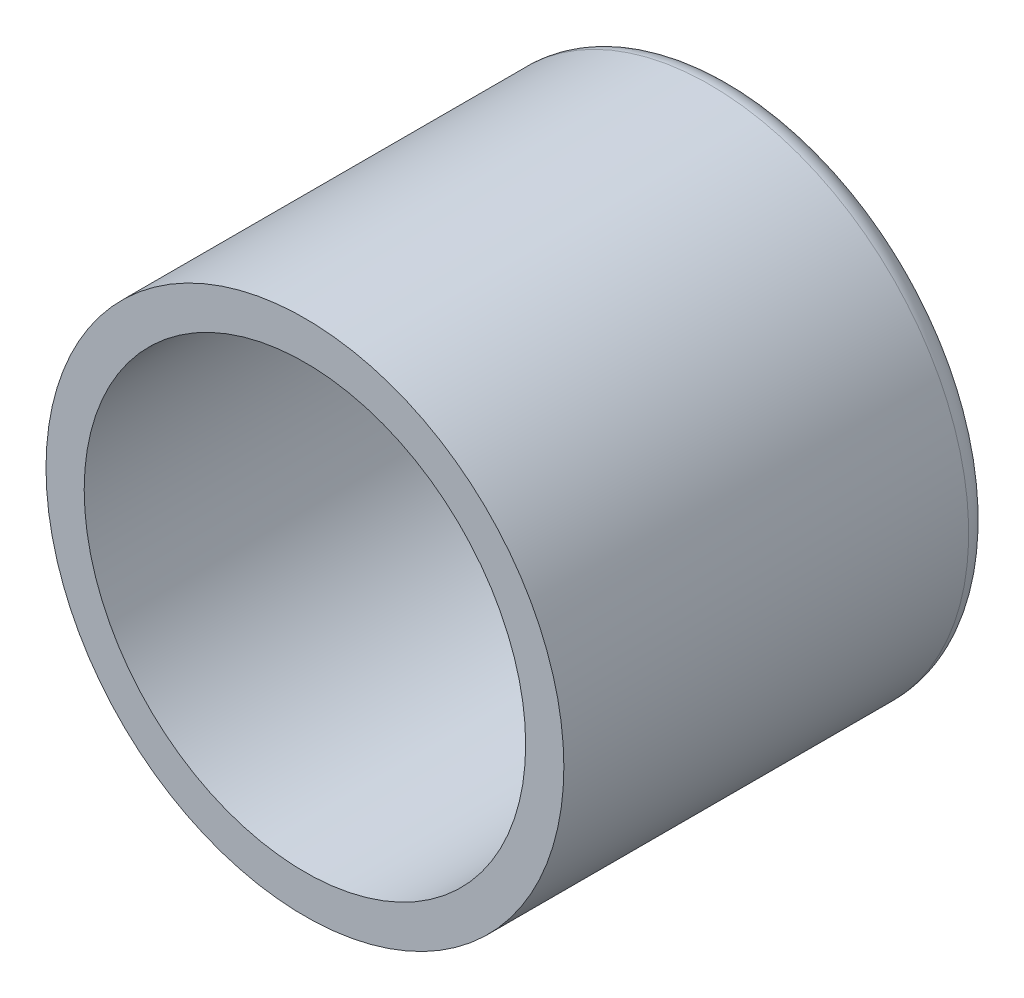
ISO-10303-21;
HEADER;
FILE_DESCRIPTION(('STEP AP214'),'2;1');
FILE_NAME('part.step','',(''),(''),'','','');
FILE_SCHEMA(('AUTOMOTIVE_DESIGN { 1 0 10303 214 1 1 1 1 }'));
ENDSEC;
DATA;
#1=APPLICATION_CONTEXT('core data for automotive mechanical design processes');
#2=APPLICATION_PROTOCOL_DEFINITION('international standard','automotive_design',2000,#1);
#3=PRODUCT_CONTEXT('',#1,'mechanical');
#4=PRODUCT('Part','Part','',(#3));
#5=PRODUCT_RELATED_PRODUCT_CATEGORY('part','',(#4));
#6=PRODUCT_DEFINITION_FORMATION('','',#4);
#7=PRODUCT_DEFINITION_CONTEXT('part definition',#1,'design');
#8=PRODUCT_DEFINITION('design','',#6,#7);
#9=PRODUCT_DEFINITION_SHAPE('','',#8);
#10=(LENGTH_UNIT() NAMED_UNIT(*) SI_UNIT(.MILLI.,.METRE.));
#11=(NAMED_UNIT(*) PLANE_ANGLE_UNIT() SI_UNIT($,.RADIAN.));
#12=(NAMED_UNIT(*) SI_UNIT($,.STERADIAN.) SOLID_ANGLE_UNIT());
#13=UNCERTAINTY_MEASURE_WITH_UNIT(LENGTH_MEASURE(1.E-05),#10,'distance_accuracy_value','');
#14=(GEOMETRIC_REPRESENTATION_CONTEXT(3) GLOBAL_UNCERTAINTY_ASSIGNED_CONTEXT((#13)) GLOBAL_UNIT_ASSIGNED_CONTEXT((#10,
#11,#12)) REPRESENTATION_CONTEXT('',''));
#15=CARTESIAN_POINT('',(0.,0.,0.));
#16=DIRECTION('',(0.,0.,1.));
#17=DIRECTION('',(1.,0.,0.));
#18=AXIS2_PLACEMENT_3D('',#15,#16,#17);
#19=CARTESIAN_POINT('',(0.,0.,25.));
#20=DIRECTION('',(0.,0.,1.));
#21=DIRECTION('',(1.,0.,0.));
#22=AXIS2_PLACEMENT_3D('',#19,#20,#21);
#23=PLANE('',#22);
#24=CARTESIAN_POINT('',(0.,0.,25.));
#25=DIRECTION('',(0.,0.,1.));
#26=DIRECTION('',(1.,0.,0.));
#27=AXIS2_PLACEMENT_3D('',#24,#25,#26);
#28=CIRCLE('',#27,16.95);
#29=CARTESIAN_POINT('',(16.95,0.,25.));
#30=VERTEX_POINT('',#29);
#31=EDGE_CURVE('E46',#30,#30,#28,.T.);
#32=ORIENTED_EDGE('',*,*,#31,.T.);
#33=EDGE_LOOP('',(#32));
#34=FACE_BOUND('',#33,.T.);
#35=CARTESIAN_POINT('',(0.,0.,25.));
#36=DIRECTION('',(0.,0.,1.));
#37=DIRECTION('',(1.,0.,0.));
#38=AXIS2_PLACEMENT_3D('',#35,#36,#37);
#39=CIRCLE('',#38,14.45);
#40=CARTESIAN_POINT('',(14.45,0.,25.));
#41=VERTEX_POINT('',#40);
#42=EDGE_CURVE('E50',#41,#41,#39,.T.);
#43=ORIENTED_EDGE('',*,*,#42,.F.);
#44=EDGE_LOOP('',(#43));
#45=FACE_BOUND('',#44,.T.);
#46=ADVANCED_FACE('F35',(#34,#45),#23,.T.);
#47=CARTESIAN_POINT('',(0.,0.,25.));
#48=DIRECTION('',(0.,0.,-1.));
#49=DIRECTION('',(-1.,0.,0.));
#50=AXIS2_PLACEMENT_3D('',#47,#48,#49);
#51=CYLINDRICAL_SURFACE('',#50,16.95);
#52=CARTESIAN_POINT('',(0.,0.,-1.5));
#53=DIRECTION('',(0.,0.,-1.));
#54=DIRECTION('',(-1.,0.,0.));
#55=AXIS2_PLACEMENT_3D('',#52,#53,#54);
#56=CIRCLE('',#55,16.95);
#57=CARTESIAN_POINT('',(-16.95,0.,-1.5));
#58=VERTEX_POINT('',#57);
#59=EDGE_CURVE('E10',#58,#58,#56,.F.);
#60=ORIENTED_EDGE('',*,*,#59,.T.);
#61=EDGE_LOOP('',(#60));
#62=FACE_BOUND('',#61,.T.);
#63=ORIENTED_EDGE('',*,*,#31,.F.);
#64=EDGE_LOOP('',(#63));
#65=FACE_BOUND('',#64,.T.);
#66=ADVANCED_FACE('F63',(#62,#65),#51,.T.);
#67=CARTESIAN_POINT('',(0.,0.,25.));
#68=DIRECTION('',(0.,0.,-1.));
#69=DIRECTION('',(-1.,0.,0.));
#70=AXIS2_PLACEMENT_3D('',#67,#68,#69);
#71=CYLINDRICAL_SURFACE('',#70,14.45);
#72=ORIENTED_EDGE('',*,*,#42,.T.);
#73=EDGE_LOOP('',(#72));
#74=FACE_BOUND('',#73,.T.);
#75=CARTESIAN_POINT('',(0.,0.,0.));
#76=DIRECTION('',(0.,0.,1.));
#77=DIRECTION('',(1.,0.,0.));
#78=AXIS2_PLACEMENT_3D('',#75,#76,#77);
#79=CIRCLE('',#78,14.45);
#80=CARTESIAN_POINT('',(14.45,0.,0.));
#81=VERTEX_POINT('',#80);
#82=EDGE_CURVE('E53',#81,#81,#79,.T.);
#83=ORIENTED_EDGE('',*,*,#82,.F.);
#84=EDGE_LOOP('',(#83));
#85=FACE_BOUND('',#84,.T.);
#86=ADVANCED_FACE('F59',(#74,#85),#71,.F.);
#87=CARTESIAN_POINT('',(0.,0.,0.));
#88=DIRECTION('',(0.,0.,-1.));
#89=DIRECTION('',(-1.,0.,0.));
#90=AXIS2_PLACEMENT_3D('',#87,#88,#89);
#91=PLANE('',#90);
#92=ORIENTED_EDGE('',*,*,#82,.T.);
#93=EDGE_LOOP('',(#92));
#94=FACE_BOUND('',#93,.T.);
#95=ADVANCED_FACE('F72',(#94),#91,.F.);
#96=CARTESIAN_POINT('',(0.,0.,-3.));
#97=DIRECTION('',(0.,0.,-1.));
#98=DIRECTION('',(-1.,0.,0.));
#99=AXIS2_PLACEMENT_3D('',#96,#97,#98);
#100=PLANE('',#99);
#101=CARTESIAN_POINT('',(0.,0.,-3.));
#102=DIRECTION('',(0.,0.,-1.));
#103=DIRECTION('',(-1.,0.,0.));
#104=AXIS2_PLACEMENT_3D('',#101,#102,#103);
#105=CIRCLE('',#104,15.45);
#106=CARTESIAN_POINT('',(-15.45,0.,-3.));
#107=VERTEX_POINT('',#106);
#108=EDGE_CURVE('E42',#107,#107,#105,.T.);
#109=ORIENTED_EDGE('',*,*,#108,.T.);
#110=EDGE_LOOP('',(#109));
#111=FACE_BOUND('',#110,.T.);
#112=ADVANCED_FACE('F75',(#111),#100,.T.);
#113=CARTESIAN_POINT('',(0.,0.,-1.5));
#114=DIRECTION('',(0.,0.,-1.));
#115=DIRECTION('',(-1.,0.,0.));
#116=AXIS2_PLACEMENT_3D('',#113,#114,#115);
#117=TOROIDAL_SURFACE('',#116,15.45,1.5);
#118=ORIENTED_EDGE('',*,*,#59,.F.);
#119=EDGE_LOOP('',(#118));
#120=FACE_BOUND('',#119,.T.);
#121=ORIENTED_EDGE('',*,*,#108,.F.);
#122=EDGE_LOOP('',(#121));
#123=FACE_BOUND('',#122,.T.);
#124=ADVANCED_FACE('F37',(#120,#123),#117,.T.);
#125=CLOSED_SHELL('',(#46,#66,#86,#95,#112,#124));
#126=MANIFOLD_SOLID_BREP('B2',#125);
#127=ADVANCED_BREP_SHAPE_REPRESENTATION('',(#18,#126),#14);
#128=SHAPE_DEFINITION_REPRESENTATION(#9,#127);
ENDSEC;
END-ISO-10303-21;
